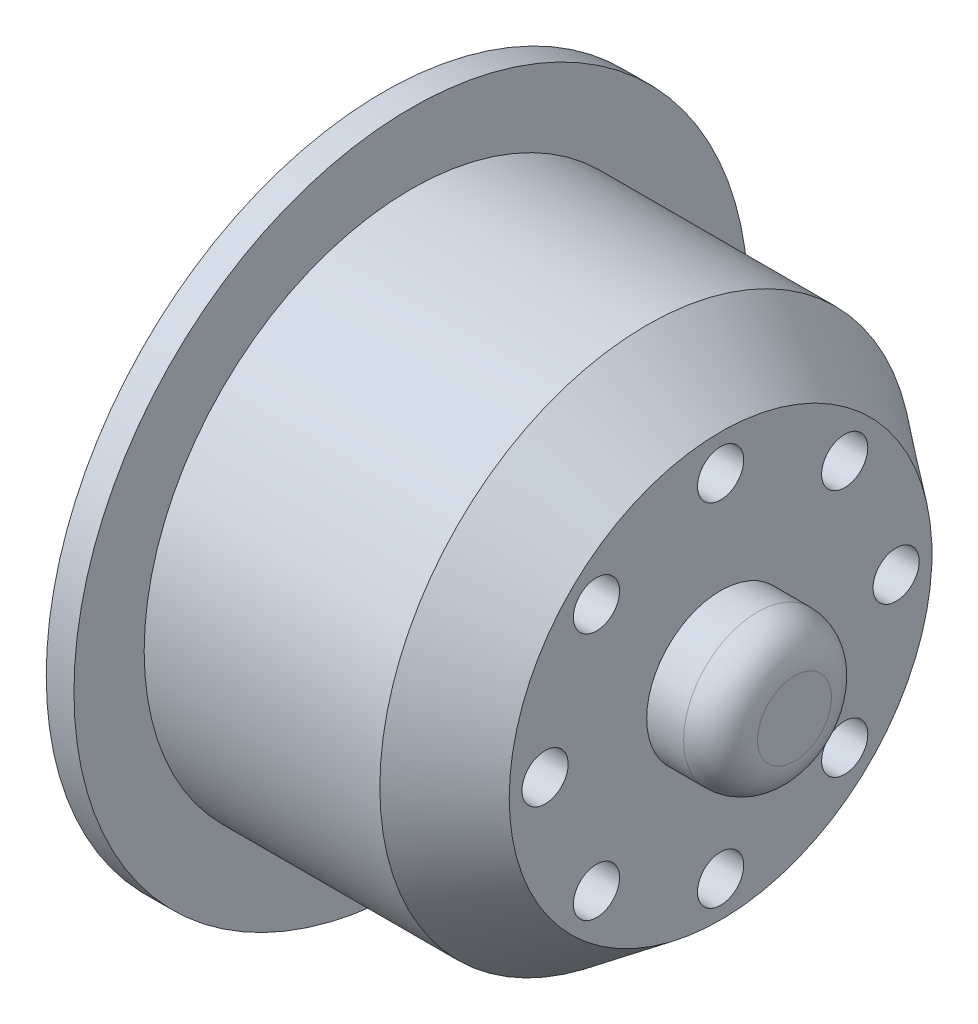
ISO-10303-21;
HEADER;
FILE_DESCRIPTION(('STEP AP214'),'2;1');
FILE_NAME('part.step','',(''),(''),'','','');
FILE_SCHEMA(('AUTOMOTIVE_DESIGN { 1 0 10303 214 1 1 1 1 }'));
ENDSEC;
DATA;
#1=APPLICATION_CONTEXT('core data for automotive mechanical design processes');
#2=APPLICATION_PROTOCOL_DEFINITION('international standard','automotive_design',2000,#1);
#3=PRODUCT_CONTEXT('',#1,'mechanical');
#4=PRODUCT('Part','Part','',(#3));
#5=PRODUCT_RELATED_PRODUCT_CATEGORY('part','',(#4));
#6=PRODUCT_DEFINITION_FORMATION('','',#4);
#7=PRODUCT_DEFINITION_CONTEXT('part definition',#1,'design');
#8=PRODUCT_DEFINITION('design','',#6,#7);
#9=PRODUCT_DEFINITION_SHAPE('','',#8);
#10=(LENGTH_UNIT() NAMED_UNIT(*) SI_UNIT(.MILLI.,.METRE.));
#11=(NAMED_UNIT(*) PLANE_ANGLE_UNIT() SI_UNIT($,.RADIAN.));
#12=(NAMED_UNIT(*) SI_UNIT($,.STERADIAN.) SOLID_ANGLE_UNIT());
#13=UNCERTAINTY_MEASURE_WITH_UNIT(LENGTH_MEASURE(1.E-05),#10,'distance_accuracy_value','');
#14=(GEOMETRIC_REPRESENTATION_CONTEXT(3) GLOBAL_UNCERTAINTY_ASSIGNED_CONTEXT((#13)) GLOBAL_UNIT_ASSIGNED_CONTEXT((#10,
#11,#12)) REPRESENTATION_CONTEXT('',''));
#15=CARTESIAN_POINT('',(0.,0.,0.));
#16=DIRECTION('',(0.,0.,1.));
#17=DIRECTION('',(1.,0.,0.));
#18=AXIS2_PLACEMENT_3D('',#15,#16,#17);
#19=CARTESIAN_POINT('',(-7.6304347826087,6.71751442127166,6.71751442127198));
#20=DIRECTION('',(1.,0.,0.));
#21=DIRECTION('',(0.,0.,-1.));
#22=AXIS2_PLACEMENT_3D('',#19,#20,#21);
#23=CYLINDRICAL_SURFACE('',#22,1.25);
#24=CARTESIAN_POINT('',(10.6195652173913,6.71751442127166,6.71751442127198));
#25=DIRECTION('',(1.,0.,0.));
#26=DIRECTION('',(0.,0.,-1.));
#27=AXIS2_PLACEMENT_3D('',#24,#25,#26);
#28=CIRCLE('',#27,1.25);
#29=CARTESIAN_POINT('',(10.6195652173913,6.71751442127166,5.46751442127198));
#30=VERTEX_POINT('',#29);
#31=EDGE_CURVE('E89',#30,#30,#28,.T.);
#32=ORIENTED_EDGE('',*,*,#31,.T.);
#33=EDGE_LOOP('',(#32));
#34=FACE_BOUND('',#33,.T.);
#35=CARTESIAN_POINT('',(5.61956521739131,6.71751442127166,6.71751442127198));
#36=DIRECTION('',(-1.,0.,0.));
#37=DIRECTION('',(0.,0.,1.));
#38=AXIS2_PLACEMENT_3D('',#35,#36,#37);
#39=CIRCLE('',#38,1.25);
#40=CARTESIAN_POINT('',(5.61956521739131,6.71751442127166,7.96751442127198));
#41=VERTEX_POINT('',#40);
#42=EDGE_CURVE('E43',#41,#41,#39,.F.);
#43=ORIENTED_EDGE('',*,*,#42,.F.);
#44=EDGE_LOOP('',(#43));
#45=FACE_BOUND('',#44,.T.);
#46=ADVANCED_FACE('F39',(#34,#45),#23,.F.);
#47=CARTESIAN_POINT('',(-7.6304347826087,-7.66926912071228E-13,9.49999999999923));
#48=DIRECTION('',(1.,0.,0.));
#49=DIRECTION('',(0.,0.,-1.));
#50=AXIS2_PLACEMENT_3D('',#47,#48,#49);
#51=CYLINDRICAL_SURFACE('',#50,1.25);
#52=CARTESIAN_POINT('',(10.6195652173913,-7.66926912071228E-13,9.49999999999923));
#53=DIRECTION('',(1.,0.,0.));
#54=DIRECTION('',(0.,0.,-1.));
#55=AXIS2_PLACEMENT_3D('',#52,#53,#54);
#56=CIRCLE('',#55,1.25);
#57=CARTESIAN_POINT('',(10.6195652173913,-7.66926912071228E-13,8.24999999999924));
#58=VERTEX_POINT('',#57);
#59=EDGE_CURVE('E94',#58,#58,#56,.T.);
#60=ORIENTED_EDGE('',*,*,#59,.T.);
#61=EDGE_LOOP('',(#60));
#62=FACE_BOUND('',#61,.T.);
#63=CARTESIAN_POINT('',(5.61956521739131,-7.66926912071228E-13,9.49999999999923));
#64=DIRECTION('',(-1.,0.,0.));
#65=DIRECTION('',(0.,0.,1.));
#66=AXIS2_PLACEMENT_3D('',#63,#64,#65);
#67=CIRCLE('',#66,1.25);
#68=CARTESIAN_POINT('',(5.61956521739131,-7.66926912071228E-13,10.7499999999992));
#69=VERTEX_POINT('',#68);
#70=EDGE_CURVE('E82',#69,#69,#67,.F.);
#71=ORIENTED_EDGE('',*,*,#70,.F.);
#72=EDGE_LOOP('',(#71));
#73=FACE_BOUND('',#72,.T.);
#74=ADVANCED_FACE('F166',(#62,#73),#51,.F.);
#75=CARTESIAN_POINT('',(-7.6304347826087,-6.71751442127274,6.7175144212709));
#76=DIRECTION('',(1.,0.,0.));
#77=DIRECTION('',(0.,0.,-1.));
#78=AXIS2_PLACEMENT_3D('',#75,#76,#77);
#79=CYLINDRICAL_SURFACE('',#78,1.25);
#80=CARTESIAN_POINT('',(10.6195652173913,-6.71751442127274,6.7175144212709));
#81=DIRECTION('',(1.,0.,0.));
#82=DIRECTION('',(0.,0.,-1.));
#83=AXIS2_PLACEMENT_3D('',#80,#81,#82);
#84=CIRCLE('',#83,1.25);
#85=CARTESIAN_POINT('',(10.6195652173913,-6.71751442127274,5.4675144212709));
#86=VERTEX_POINT('',#85);
#87=EDGE_CURVE('E100',#86,#86,#84,.T.);
#88=ORIENTED_EDGE('',*,*,#87,.T.);
#89=EDGE_LOOP('',(#88));
#90=FACE_BOUND('',#89,.T.);
#91=CARTESIAN_POINT('',(5.61956521739131,-6.71751442127274,6.7175144212709));
#92=DIRECTION('',(-1.,0.,0.));
#93=DIRECTION('',(0.,0.,1.));
#94=AXIS2_PLACEMENT_3D('',#91,#92,#93);
#95=CIRCLE('',#94,1.25);
#96=CARTESIAN_POINT('',(5.61956521739131,-6.71751442127274,7.9675144212709));
#97=VERTEX_POINT('',#96);
#98=EDGE_CURVE('E79',#97,#97,#95,.F.);
#99=ORIENTED_EDGE('',*,*,#98,.F.);
#100=EDGE_LOOP('',(#99));
#101=FACE_BOUND('',#100,.T.);
#102=ADVANCED_FACE('F171',(#90,#101),#79,.F.);
#103=CARTESIAN_POINT('',(-7.6304347826087,-9.5,-1.53152699522408E-12));
#104=DIRECTION('',(1.,0.,0.));
#105=DIRECTION('',(0.,0.,-1.));
#106=AXIS2_PLACEMENT_3D('',#103,#104,#105);
#107=CYLINDRICAL_SURFACE('',#106,1.25);
#108=CARTESIAN_POINT('',(10.6195652173913,-9.5,-1.53152699522408E-12));
#109=DIRECTION('',(1.,0.,0.));
#110=DIRECTION('',(0.,0.,-1.));
#111=AXIS2_PLACEMENT_3D('',#108,#109,#110);
#112=CIRCLE('',#111,1.25);
#113=CARTESIAN_POINT('',(10.6195652173913,-9.5,-1.25000000000153));
#114=VERTEX_POINT('',#113);
#115=EDGE_CURVE('E359',#114,#114,#112,.T.);
#116=ORIENTED_EDGE('',*,*,#115,.T.);
#117=EDGE_LOOP('',(#116));
#118=FACE_BOUND('',#117,.T.);
#119=CARTESIAN_POINT('',(5.61956521739131,-9.5,-1.53152699522408E-12));
#120=DIRECTION('',(-1.,0.,0.));
#121=DIRECTION('',(0.,0.,1.));
#122=AXIS2_PLACEMENT_3D('',#119,#120,#121);
#123=CIRCLE('',#122,1.25);
#124=CARTESIAN_POINT('',(5.61956521739131,-9.5,1.24999999999847));
#125=VERTEX_POINT('',#124);
#126=EDGE_CURVE('E75',#125,#125,#123,.F.);
#127=ORIENTED_EDGE('',*,*,#126,.F.);
#128=EDGE_LOOP('',(#127));
#129=FACE_BOUND('',#128,.T.);
#130=ADVANCED_FACE('F178',(#118,#129),#107,.F.);
#131=CARTESIAN_POINT('',(-7.6304347826087,-6.71751442127166,-6.71751442127351));
#132=DIRECTION('',(1.,0.,0.));
#133=DIRECTION('',(0.,0.,-1.));
#134=AXIS2_PLACEMENT_3D('',#131,#132,#133);
#135=CYLINDRICAL_SURFACE('',#134,1.25);
#136=CARTESIAN_POINT('',(10.6195652173913,-6.71751442127166,-6.71751442127351));
#137=DIRECTION('',(1.,0.,0.));
#138=DIRECTION('',(0.,0.,-1.));
#139=AXIS2_PLACEMENT_3D('',#136,#137,#138);
#140=CIRCLE('',#139,1.25);
#141=CARTESIAN_POINT('',(10.6195652173913,-6.71751442127166,-7.96751442127351));
#142=VERTEX_POINT('',#141);
#143=EDGE_CURVE('E355',#142,#142,#140,.T.);
#144=ORIENTED_EDGE('',*,*,#143,.T.);
#145=EDGE_LOOP('',(#144));
#146=FACE_BOUND('',#145,.T.);
#147=CARTESIAN_POINT('',(5.61956521739131,-6.71751442127166,-6.71751442127351));
#148=DIRECTION('',(-1.,0.,0.));
#149=DIRECTION('',(0.,0.,1.));
#150=AXIS2_PLACEMENT_3D('',#147,#148,#149);
#151=CIRCLE('',#150,1.25);
#152=CARTESIAN_POINT('',(5.61956521739131,-6.71751442127166,-5.46751442127351));
#153=VERTEX_POINT('',#152);
#154=EDGE_CURVE('E71',#153,#153,#151,.F.);
#155=ORIENTED_EDGE('',*,*,#154,.F.);
#156=EDGE_LOOP('',(#155));
#157=FACE_BOUND('',#156,.T.);
#158=ADVANCED_FACE('F182',(#146,#157),#135,.F.);
#159=CARTESIAN_POINT('',(-7.6304347826087,7.65763497612038E-13,-9.50000000000077));
#160=DIRECTION('',(1.,0.,0.));
#161=DIRECTION('',(0.,0.,-1.));
#162=AXIS2_PLACEMENT_3D('',#159,#160,#161);
#163=CYLINDRICAL_SURFACE('',#162,1.25);
#164=CARTESIAN_POINT('',(10.6195652173913,7.65763497612038E-13,-9.50000000000077));
#165=DIRECTION('',(1.,0.,0.));
#166=DIRECTION('',(0.,0.,-1.));
#167=AXIS2_PLACEMENT_3D('',#164,#165,#166);
#168=CIRCLE('',#167,1.25);
#169=CARTESIAN_POINT('',(10.6195652173913,7.65763497612038E-13,-10.7500000000008));
#170=VERTEX_POINT('',#169);
#171=EDGE_CURVE('E351',#170,#170,#168,.T.);
#172=ORIENTED_EDGE('',*,*,#171,.T.);
#173=EDGE_LOOP('',(#172));
#174=FACE_BOUND('',#173,.T.);
#175=CARTESIAN_POINT('',(5.61956521739131,7.65763497612038E-13,-9.50000000000077));
#176=DIRECTION('',(-1.,0.,0.));
#177=DIRECTION('',(0.,0.,1.));
#178=AXIS2_PLACEMENT_3D('',#175,#176,#177);
#179=CIRCLE('',#178,1.25);
#180=CARTESIAN_POINT('',(5.61956521739131,7.65763497612038E-13,-8.25000000000077));
#181=VERTEX_POINT('',#180);
#182=EDGE_CURVE('E67',#181,#181,#179,.F.);
#183=ORIENTED_EDGE('',*,*,#182,.F.);
#184=EDGE_LOOP('',(#183));
#185=FACE_BOUND('',#184,.T.);
#186=ADVANCED_FACE('F186',(#174,#185),#163,.F.);
#187=CARTESIAN_POINT('',(-7.6304347826087,6.71751442127274,-6.71751442127242));
#188=DIRECTION('',(1.,0.,0.));
#189=DIRECTION('',(0.,0.,-1.));
#190=AXIS2_PLACEMENT_3D('',#187,#188,#189);
#191=CYLINDRICAL_SURFACE('',#190,1.25);
#192=CARTESIAN_POINT('',(10.6195652173913,6.71751442127274,-6.71751442127242));
#193=DIRECTION('',(1.,0.,0.));
#194=DIRECTION('',(0.,0.,-1.));
#195=AXIS2_PLACEMENT_3D('',#192,#193,#194);
#196=CIRCLE('',#195,1.25);
#197=CARTESIAN_POINT('',(10.6195652173913,6.71751442127274,-7.96751442127243));
#198=VERTEX_POINT('',#197);
#199=EDGE_CURVE('E347',#198,#198,#196,.T.);
#200=ORIENTED_EDGE('',*,*,#199,.T.);
#201=EDGE_LOOP('',(#200));
#202=FACE_BOUND('',#201,.T.);
#203=CARTESIAN_POINT('',(5.61956521739131,6.71751442127274,-6.71751442127242));
#204=DIRECTION('',(-1.,0.,0.));
#205=DIRECTION('',(0.,0.,1.));
#206=AXIS2_PLACEMENT_3D('',#203,#204,#205);
#207=CIRCLE('',#206,1.25);
#208=CARTESIAN_POINT('',(5.61956521739131,6.71751442127274,-5.46751442127242));
#209=VERTEX_POINT('',#208);
#210=EDGE_CURVE('E62',#209,#209,#207,.F.);
#211=ORIENTED_EDGE('',*,*,#210,.F.);
#212=EDGE_LOOP('',(#211));
#213=FACE_BOUND('',#212,.T.);
#214=ADVANCED_FACE('F190',(#202,#213),#191,.F.);
#215=CARTESIAN_POINT('',(-7.6304347826087,9.5,0.));
#216=DIRECTION('',(1.,0.,0.));
#217=DIRECTION('',(0.,0.,-1.));
#218=AXIS2_PLACEMENT_3D('',#215,#216,#217);
#219=CYLINDRICAL_SURFACE('',#218,1.25);
#220=CARTESIAN_POINT('',(10.6195652173913,9.5,0.));
#221=DIRECTION('',(1.,0.,0.));
#222=DIRECTION('',(0.,0.,-1.));
#223=AXIS2_PLACEMENT_3D('',#220,#221,#222);
#224=CIRCLE('',#223,1.25);
#225=CARTESIAN_POINT('',(10.6195652173913,9.5,-1.25));
#226=VERTEX_POINT('',#225);
#227=EDGE_CURVE('E109',#226,#226,#224,.T.);
#228=ORIENTED_EDGE('',*,*,#227,.T.);
#229=EDGE_LOOP('',(#228));
#230=FACE_BOUND('',#229,.T.);
#231=CARTESIAN_POINT('',(5.61956521739131,9.5,0.));
#232=DIRECTION('',(-1.,0.,0.));
#233=DIRECTION('',(0.,0.,1.));
#234=AXIS2_PLACEMENT_3D('',#231,#232,#233);
#235=CIRCLE('',#234,1.25);
#236=CARTESIAN_POINT('',(5.61956521739131,9.5,1.25));
#237=VERTEX_POINT('',#236);
#238=EDGE_CURVE('E58',#237,#237,#235,.F.);
#239=ORIENTED_EDGE('',*,*,#238,.F.);
#240=EDGE_LOOP('',(#239));
#241=FACE_BOUND('',#240,.T.);
#242=ADVANCED_FACE('F133',(#230,#241),#219,.F.);
#243=CARTESIAN_POINT('',(-6.1304347826087,0.,-14.45));
#244=DIRECTION('',(-1.,0.,0.));
#245=DIRECTION('',(0.,0.,1.));
#246=AXIS2_PLACEMENT_3D('',#243,#244,#245);
#247=PLANE('',#246);
#248=CARTESIAN_POINT('',(-6.1304347826087,0.,0.));
#249=DIRECTION('',(-1.,0.,0.));
#250=DIRECTION('',(0.,0.,1.));
#251=AXIS2_PLACEMENT_3D('',#248,#249,#250);
#252=CIRCLE('',#251,18.25);
#253=CARTESIAN_POINT('',(-6.1304347826087,0.,18.25));
#254=VERTEX_POINT('',#253);
#255=EDGE_CURVE('E54',#254,#254,#252,.T.);
#256=ORIENTED_EDGE('',*,*,#255,.F.);
#257=EDGE_LOOP('',(#256));
#258=FACE_BOUND('',#257,.T.);
#259=CARTESIAN_POINT('',(-6.1304347826087,0.,0.));
#260=DIRECTION('',(-1.,0.,0.));
#261=DIRECTION('',(0.,0.,1.));
#262=AXIS2_PLACEMENT_3D('',#259,#260,#261);
#263=CIRCLE('',#262,14.45);
#264=CARTESIAN_POINT('',(-6.1304347826087,0.,14.45));
#265=VERTEX_POINT('',#264);
#266=EDGE_CURVE('E104',#265,#265,#263,.T.);
#267=ORIENTED_EDGE('',*,*,#266,.T.);
#268=EDGE_LOOP('',(#267));
#269=FACE_BOUND('',#268,.T.);
#270=ADVANCED_FACE('F130',(#258,#269),#247,.F.);
#271=CARTESIAN_POINT('',(-12.3913043478261,0.,0.));
#272=DIRECTION('',(-1.,0.,0.));
#273=DIRECTION('',(0.,0.,1.));
#274=AXIS2_PLACEMENT_3D('',#271,#272,#273);
#275=CYLINDRICAL_SURFACE('',#274,18.25);
#276=CARTESIAN_POINT('',(-7.6304347826087,0.,0.));
#277=DIRECTION('',(-1.,0.,0.));
#278=DIRECTION('',(0.,0.,1.));
#279=AXIS2_PLACEMENT_3D('',#276,#277,#278);
#280=CIRCLE('',#279,18.25);
#281=CARTESIAN_POINT('',(-7.6304347826087,0.,18.25));
#282=VERTEX_POINT('',#281);
#283=EDGE_CURVE('E121',#282,#282,#280,.T.);
#284=ORIENTED_EDGE('',*,*,#283,.F.);
#285=EDGE_LOOP('',(#284));
#286=FACE_BOUND('',#285,.T.);
#287=ORIENTED_EDGE('',*,*,#255,.T.);
#288=EDGE_LOOP('',(#287));
#289=FACE_BOUND('',#288,.T.);
#290=ADVANCED_FACE('F128',(#286,#289),#275,.T.);
#291=CARTESIAN_POINT('',(-7.6304347826087,0.,-18.25));
#292=DIRECTION('',(1.,0.,0.));
#293=DIRECTION('',(0.,0.,-1.));
#294=AXIS2_PLACEMENT_3D('',#291,#292,#293);
#295=PLANE('',#294);
#296=CARTESIAN_POINT('',(-7.6304347826087,0.,0.));
#297=DIRECTION('',(-1.,0.,0.));
#298=DIRECTION('',(0.,0.,1.));
#299=AXIS2_PLACEMENT_3D('',#296,#297,#298);
#300=CIRCLE('',#299,5.1);
#301=CARTESIAN_POINT('',(-7.6304347826087,0.,5.1));
#302=VERTEX_POINT('',#301);
#303=EDGE_CURVE('E276',#302,#302,#300,.T.);
#304=ORIENTED_EDGE('',*,*,#303,.F.);
#305=EDGE_LOOP('',(#304));
#306=FACE_BOUND('',#305,.T.);
#307=CARTESIAN_POINT('',(-7.6304347826087,6.71751442127125,-6.71751442127159));
#308=DIRECTION('',(-1.,0.,0.));
#309=DIRECTION('',(0.,0.,1.));
#310=AXIS2_PLACEMENT_3D('',#307,#308,#309);
#311=CIRCLE('',#310,2.50000000000051);
#312=CARTESIAN_POINT('',(-7.6304347826087,6.71751442127125,-4.21751442127108));
#313=VERTEX_POINT('',#312);
#314=EDGE_CURVE('E275',#313,#313,#311,.T.);
#315=ORIENTED_EDGE('',*,*,#314,.F.);
#316=EDGE_LOOP('',(#315));
#317=FACE_BOUND('',#316,.T.);
#318=CARTESIAN_POINT('',(-7.6304347826087,-8.09437011536873E-13,-9.49999999999865));
#319=DIRECTION('',(-1.,0.,0.));
#320=DIRECTION('',(0.,0.,1.));
#321=AXIS2_PLACEMENT_3D('',#318,#319,#320);
#322=CIRCLE('',#321,2.5000000000011);
#323=CARTESIAN_POINT('',(-7.6304347826087,-8.09437011536873E-13,-6.99999999999755));
#324=VERTEX_POINT('',#323);
#325=EDGE_CURVE('E328',#324,#324,#322,.T.);
#326=ORIENTED_EDGE('',*,*,#325,.F.);
#327=EDGE_LOOP('',(#326));
#328=FACE_BOUND('',#327,.T.);
#329=CARTESIAN_POINT('',(-7.6304347826087,-6.71751442127239,-6.71751442127044));
#330=DIRECTION('',(-1.,0.,0.));
#331=DIRECTION('',(0.,0.,1.));
#332=AXIS2_PLACEMENT_3D('',#329,#330,#331);
#333=CIRCLE('',#332,2.50000000000157);
#334=CARTESIAN_POINT('',(-7.6304347826087,-6.71751442127239,-4.21751442126887));
#335=VERTEX_POINT('',#334);
#336=EDGE_CURVE('E320',#335,#335,#333,.T.);
#337=ORIENTED_EDGE('',*,*,#336,.F.);
#338=EDGE_LOOP('',(#337));
#339=FACE_BOUND('',#338,.T.);
#340=CARTESIAN_POINT('',(-7.6304347826087,-9.49999999999946,1.61654719415537E-12));
#341=DIRECTION('',(-1.,0.,0.));
#342=DIRECTION('',(0.,0.,1.));
#343=AXIS2_PLACEMENT_3D('',#340,#341,#342);
#344=CIRCLE('',#343,2.50000000000161);
#345=CARTESIAN_POINT('',(-7.6304347826087,-9.49999999999946,2.50000000000323));
#346=VERTEX_POINT('',#345);
#347=EDGE_CURVE('E312',#346,#346,#344,.T.);
#348=ORIENTED_EDGE('',*,*,#347,.F.);
#349=EDGE_LOOP('',(#348));
#350=FACE_BOUND('',#349,.T.);
#351=CARTESIAN_POINT('',(-7.6304347826087,-6.71751442127125,6.7175144212732));
#352=DIRECTION('',(-1.,0.,0.));
#353=DIRECTION('',(0.,0.,1.));
#354=AXIS2_PLACEMENT_3D('',#351,#352,#353);
#355=CIRCLE('',#354,2.5000000000012);
#356=CARTESIAN_POINT('',(-7.6304347826087,-6.71751442127125,9.2175144212744));
#357=VERTEX_POINT('',#356);
#358=EDGE_CURVE('E304',#357,#357,#355,.T.);
#359=ORIENTED_EDGE('',*,*,#358,.F.);
#360=EDGE_LOOP('',(#359));
#361=FACE_BOUND('',#360,.T.);
#362=CARTESIAN_POINT('',(-7.6304347826087,8.08273597077683E-13,9.50000000000027));
#363=DIRECTION('',(-1.,0.,0.));
#364=DIRECTION('',(0.,0.,1.));
#365=AXIS2_PLACEMENT_3D('',#362,#363,#364);
#366=CIRCLE('',#365,2.50000000000057);
#367=CARTESIAN_POINT('',(-7.6304347826087,8.08273597077683E-13,12.0000000000008));
#368=VERTEX_POINT('',#367);
#369=EDGE_CURVE('E296',#368,#368,#366,.T.);
#370=ORIENTED_EDGE('',*,*,#369,.F.);
#371=EDGE_LOOP('',(#370));
#372=FACE_BOUND('',#371,.T.);
#373=CARTESIAN_POINT('',(-7.6304347826087,6.71751442127239,6.71751442127206));
#374=DIRECTION('',(-1.,0.,0.));
#375=DIRECTION('',(0.,0.,1.));
#376=AXIS2_PLACEMENT_3D('',#373,#374,#375);
#377=CIRCLE('',#376,2.50000000000008);
#378=CARTESIAN_POINT('',(-7.6304347826087,6.71751442127239,9.21751442127213));
#379=VERTEX_POINT('',#378);
#380=EDGE_CURVE('E286',#379,#379,#377,.T.);
#381=ORIENTED_EDGE('',*,*,#380,.F.);
#382=EDGE_LOOP('',(#381));
#383=FACE_BOUND('',#382,.T.);
#384=CARTESIAN_POINT('',(-7.6304347826087,9.49999999999946,0.));
#385=DIRECTION('',(-1.,0.,0.));
#386=DIRECTION('',(0.,0.,1.));
#387=AXIS2_PLACEMENT_3D('',#384,#385,#386);
#388=CIRCLE('',#387,2.5);
#389=CARTESIAN_POINT('',(-7.6304347826087,9.49999999999946,2.5));
#390=VERTEX_POINT('',#389);
#391=EDGE_CURVE('E295',#390,#390,#388,.T.);
#392=ORIENTED_EDGE('',*,*,#391,.F.);
#393=EDGE_LOOP('',(#392));
#394=FACE_BOUND('',#393,.T.);
#395=ORIENTED_EDGE('',*,*,#283,.T.);
#396=EDGE_LOOP('',(#395));
#397=FACE_BOUND('',#396,.T.);
#398=ADVANCED_FACE('F163',(#306,#317,#328,#339,#350,#361,#372,#383,#394,#397),#295,.F.);
#399=CARTESIAN_POINT('',(14.6195652173913,0.,-4.));
#400=DIRECTION('',(-1.,0.,0.));
#401=DIRECTION('',(0.,0.,1.));
#402=AXIS2_PLACEMENT_3D('',#399,#400,#401);
#403=PLANE('',#402);
#404=CARTESIAN_POINT('',(14.6195652173913,0.,0.));
#405=DIRECTION('',(-1.,0.,0.));
#406=DIRECTION('',(0.,0.,1.));
#407=AXIS2_PLACEMENT_3D('',#404,#405,#406);
#408=CIRCLE('',#407,2.);
#409=CARTESIAN_POINT('',(14.6195652173913,0.,2.));
#410=VERTEX_POINT('',#409);
#411=EDGE_CURVE('E11',#410,#410,#408,.F.);
#412=ORIENTED_EDGE('',*,*,#411,.T.);
#413=EDGE_LOOP('',(#412));
#414=FACE_BOUND('',#413,.T.);
#415=ADVANCED_FACE('F157',(#414),#403,.F.);
#416=CARTESIAN_POINT('',(-12.3913043478261,0.,0.));
#417=DIRECTION('',(-1.,0.,0.));
#418=DIRECTION('',(0.,0.,1.));
#419=AXIS2_PLACEMENT_3D('',#416,#417,#418);
#420=CYLINDRICAL_SURFACE('',#419,4.);
#421=CARTESIAN_POINT('',(12.6195652173913,0.,0.));
#422=DIRECTION('',(-1.,0.,0.));
#423=DIRECTION('',(0.,0.,1.));
#424=AXIS2_PLACEMENT_3D('',#421,#422,#423);
#425=CIRCLE('',#424,4.);
#426=CARTESIAN_POINT('',(12.6195652173913,0.,4.));
#427=VERTEX_POINT('',#426);
#428=EDGE_CURVE('E48',#427,#427,#425,.T.);
#429=ORIENTED_EDGE('',*,*,#428,.T.);
#430=EDGE_LOOP('',(#429));
#431=FACE_BOUND('',#430,.T.);
#432=CARTESIAN_POINT('',(10.6195652173913,0.,0.));
#433=DIRECTION('',(-1.,0.,0.));
#434=DIRECTION('',(0.,0.,1.));
#435=AXIS2_PLACEMENT_3D('',#432,#433,#434);
#436=CIRCLE('',#435,4.);
#437=CARTESIAN_POINT('',(10.6195652173913,0.,4.));
#438=VERTEX_POINT('',#437);
#439=EDGE_CURVE('E117',#438,#438,#436,.T.);
#440=ORIENTED_EDGE('',*,*,#439,.F.);
#441=EDGE_LOOP('',(#440));
#442=FACE_BOUND('',#441,.T.);
#443=ADVANCED_FACE('F151',(#431,#442),#420,.T.);
#444=CARTESIAN_POINT('',(10.6195652173913,0.,-11.4409248842397));
#445=DIRECTION('',(-1.,0.,0.));
#446=DIRECTION('',(0.,0.,1.));
#447=AXIS2_PLACEMENT_3D('',#444,#445,#446);
#448=PLANE('',#447);
#449=ORIENTED_EDGE('',*,*,#227,.F.);
#450=EDGE_LOOP('',(#449));
#451=FACE_BOUND('',#450,.T.);
#452=ORIENTED_EDGE('',*,*,#199,.F.);
#453=EDGE_LOOP('',(#452));
#454=FACE_BOUND('',#453,.T.);
#455=ORIENTED_EDGE('',*,*,#171,.F.);
#456=EDGE_LOOP('',(#455));
#457=FACE_BOUND('',#456,.T.);
#458=ORIENTED_EDGE('',*,*,#143,.F.);
#459=EDGE_LOOP('',(#458));
#460=FACE_BOUND('',#459,.T.);
#461=ORIENTED_EDGE('',*,*,#115,.F.);
#462=EDGE_LOOP('',(#461));
#463=FACE_BOUND('',#462,.T.);
#464=ORIENTED_EDGE('',*,*,#87,.F.);
#465=EDGE_LOOP('',(#464));
#466=FACE_BOUND('',#465,.T.);
#467=ORIENTED_EDGE('',*,*,#59,.F.);
#468=EDGE_LOOP('',(#467));
#469=FACE_BOUND('',#468,.T.);
#470=ORIENTED_EDGE('',*,*,#31,.F.);
#471=EDGE_LOOP('',(#470));
#472=FACE_BOUND('',#471,.T.);
#473=CARTESIAN_POINT('',(10.6195652173913,0.,0.));
#474=DIRECTION('',(-1.,0.,0.));
#475=DIRECTION('',(0.,0.,1.));
#476=AXIS2_PLACEMENT_3D('',#473,#474,#475);
#477=CIRCLE('',#476,11.4409248842397);
#478=CARTESIAN_POINT('',(10.6195652173913,0.,11.4409248842397));
#479=VERTEX_POINT('',#478);
#480=EDGE_CURVE('E113',#479,#479,#477,.T.);
#481=ORIENTED_EDGE('',*,*,#480,.F.);
#482=EDGE_LOOP('',(#481));
#483=FACE_BOUND('',#482,.T.);
#484=ORIENTED_EDGE('',*,*,#439,.T.);
#485=EDGE_LOOP('',(#484));
#486=FACE_BOUND('',#485,.T.);
#487=ADVANCED_FACE('F145',(#451,#454,#457,#460,#463,#466,#469,#472,#483,#486),#448,.F.);
#488=CARTESIAN_POINT('',(10.6195652173913,0.,0.));
#489=DIRECTION('',(-1.,0.,0.));
#490=DIRECTION('',(0.,0.,1.));
#491=AXIS2_PLACEMENT_3D('',#488,#489,#490);
#492=CONICAL_SURFACE('',#491,11.4409248842397,0.645771823237905);
#493=CARTESIAN_POINT('',(6.62638766715485,0.,0.));
#494=DIRECTION('',(-1.,0.,0.));
#495=DIRECTION('',(0.,0.,1.));
#496=AXIS2_PLACEMENT_3D('',#493,#494,#495);
#497=CIRCLE('',#496,14.45);
#498=CARTESIAN_POINT('',(6.62638766715485,0.,14.45));
#499=VERTEX_POINT('',#498);
#500=EDGE_CURVE('E108',#499,#499,#497,.T.);
#501=ORIENTED_EDGE('',*,*,#500,.F.);
#502=EDGE_LOOP('',(#501));
#503=FACE_BOUND('',#502,.T.);
#504=ORIENTED_EDGE('',*,*,#480,.T.);
#505=EDGE_LOOP('',(#504));
#506=FACE_BOUND('',#505,.T.);
#507=ADVANCED_FACE('F139',(#503,#506),#492,.T.);
#508=CARTESIAN_POINT('',(-12.3913043478261,0.,0.));
#509=DIRECTION('',(-1.,0.,0.));
#510=DIRECTION('',(0.,0.,1.));
#511=AXIS2_PLACEMENT_3D('',#508,#509,#510);
#512=CYLINDRICAL_SURFACE('',#511,14.45);
#513=ORIENTED_EDGE('',*,*,#266,.F.);
#514=EDGE_LOOP('',(#513));
#515=FACE_BOUND('',#514,.T.);
#516=ORIENTED_EDGE('',*,*,#500,.T.);
#517=EDGE_LOOP('',(#516));
#518=FACE_BOUND('',#517,.T.);
#519=ADVANCED_FACE('F136',(#515,#518),#512,.T.);
#520=CARTESIAN_POINT('',(12.6195652173913,0.,0.));
#521=DIRECTION('',(-1.,0.,0.));
#522=DIRECTION('',(0.,0.,1.));
#523=AXIS2_PLACEMENT_3D('',#520,#521,#522);
#524=DEGENERATE_TOROIDAL_SURFACE('',#523,2.,2.,.T.);
#525=ORIENTED_EDGE('',*,*,#411,.F.);
#526=EDGE_LOOP('',(#525));
#527=FACE_BOUND('',#526,.T.);
#528=ORIENTED_EDGE('',*,*,#428,.F.);
#529=EDGE_LOOP('',(#528));
#530=FACE_BOUND('',#529,.T.);
#531=ADVANCED_FACE('F41',(#527,#530),#524,.T.);
#532=CARTESIAN_POINT('',(5.61956521739131,0.,-11.4409248842397));
#533=DIRECTION('',(-1.,0.,0.));
#534=DIRECTION('',(0.,0.,1.));
#535=AXIS2_PLACEMENT_3D('',#532,#533,#534);
#536=PLANE('',#535);
#537=CARTESIAN_POINT('',(5.61956521739131,9.49999999999946,0.));
#538=DIRECTION('',(-1.,0.,0.));
#539=DIRECTION('',(0.,0.,1.));
#540=AXIS2_PLACEMENT_3D('',#537,#538,#539);
#541=CIRCLE('',#540,2.5);
#542=CARTESIAN_POINT('',(5.61956521739131,9.49999999999946,2.5));
#543=VERTEX_POINT('',#542);
#544=EDGE_CURVE('E63',#543,#543,#541,.F.);
#545=ORIENTED_EDGE('',*,*,#544,.F.);
#546=EDGE_LOOP('',(#545));
#547=FACE_BOUND('',#546,.T.);
#548=ORIENTED_EDGE('',*,*,#238,.T.);
#549=EDGE_LOOP('',(#548));
#550=FACE_BOUND('',#549,.T.);
#551=ADVANCED_FACE('F202',(#547,#550),#536,.T.);
#552=CARTESIAN_POINT('',(17.6906330292613,9.49999999999946,0.));
#553=DIRECTION('',(-1.,0.,0.));
#554=DIRECTION('',(0.,0.,1.));
#555=AXIS2_PLACEMENT_3D('',#552,#553,#554);
#556=CYLINDRICAL_SURFACE('',#555,2.5);
#557=ORIENTED_EDGE('',*,*,#544,.T.);
#558=EDGE_LOOP('',(#557));
#559=FACE_BOUND('',#558,.T.);
#560=ORIENTED_EDGE('',*,*,#391,.T.);
#561=EDGE_LOOP('',(#560));
#562=FACE_BOUND('',#561,.T.);
#563=ADVANCED_FACE('F198',(#559,#562),#556,.F.);
#564=CARTESIAN_POINT('',(5.61956521739131,0.,-11.4409248842397));
#565=DIRECTION('',(-1.,0.,0.));
#566=DIRECTION('',(0.,0.,1.));
#567=AXIS2_PLACEMENT_3D('',#564,#565,#566);
#568=PLANE('',#567);
#569=CARTESIAN_POINT('',(5.61956521739131,6.71751442127125,-6.71751442127159));
#570=DIRECTION('',(-1.,0.,0.));
#571=DIRECTION('',(0.,0.,1.));
#572=AXIS2_PLACEMENT_3D('',#569,#570,#571);
#573=CIRCLE('',#572,2.50000000000051);
#574=CARTESIAN_POINT('',(5.61956521739131,6.71751442127125,-4.21751442127108));
#575=VERTEX_POINT('',#574);
#576=EDGE_CURVE('E281',#575,#575,#573,.F.);
#577=ORIENTED_EDGE('',*,*,#576,.F.);
#578=EDGE_LOOP('',(#577));
#579=FACE_BOUND('',#578,.T.);
#580=ORIENTED_EDGE('',*,*,#210,.T.);
#581=EDGE_LOOP('',(#580));
#582=FACE_BOUND('',#581,.T.);
#583=ADVANCED_FACE('F201',(#579,#582),#568,.T.);
#584=CARTESIAN_POINT('',(17.6906330292613,6.71751442127125,-6.71751442127159));
#585=DIRECTION('',(-1.,0.,0.));
#586=DIRECTION('',(0.,0.,1.));
#587=AXIS2_PLACEMENT_3D('',#584,#585,#586);
#588=CYLINDRICAL_SURFACE('',#587,2.50000000000051);
#589=ORIENTED_EDGE('',*,*,#576,.T.);
#590=EDGE_LOOP('',(#589));
#591=FACE_BOUND('',#590,.T.);
#592=ORIENTED_EDGE('',*,*,#314,.T.);
#593=EDGE_LOOP('',(#592));
#594=FACE_BOUND('',#593,.T.);
#595=ADVANCED_FACE('F207',(#591,#594),#588,.F.);
#596=CARTESIAN_POINT('',(5.61956521739131,0.,-11.4409248842397));
#597=DIRECTION('',(-1.,0.,0.));
#598=DIRECTION('',(0.,0.,1.));
#599=AXIS2_PLACEMENT_3D('',#596,#597,#598);
#600=PLANE('',#599);
#601=CARTESIAN_POINT('',(5.61956521739131,-8.09437011536873E-13,-9.49999999999865));
#602=DIRECTION('',(-1.,0.,0.));
#603=DIRECTION('',(0.,0.,1.));
#604=AXIS2_PLACEMENT_3D('',#601,#602,#603);
#605=CIRCLE('',#604,2.5000000000011);
#606=CARTESIAN_POINT('',(5.61956521739131,-8.09437011536873E-13,-6.99999999999755));
#607=VERTEX_POINT('',#606);
#608=EDGE_CURVE('E324',#607,#607,#605,.F.);
#609=ORIENTED_EDGE('',*,*,#608,.F.);
#610=EDGE_LOOP('',(#609));
#611=FACE_BOUND('',#610,.T.);
#612=ORIENTED_EDGE('',*,*,#182,.T.);
#613=EDGE_LOOP('',(#612));
#614=FACE_BOUND('',#613,.T.);
#615=ADVANCED_FACE('F210',(#611,#614),#600,.T.);
#616=CARTESIAN_POINT('',(17.6906330292613,-8.09437011536873E-13,-9.49999999999865));
#617=DIRECTION('',(-1.,0.,0.));
#618=DIRECTION('',(0.,0.,1.));
#619=AXIS2_PLACEMENT_3D('',#616,#617,#618);
#620=CYLINDRICAL_SURFACE('',#619,2.5000000000011);
#621=ORIENTED_EDGE('',*,*,#608,.T.);
#622=EDGE_LOOP('',(#621));
#623=FACE_BOUND('',#622,.T.);
#624=ORIENTED_EDGE('',*,*,#325,.T.);
#625=EDGE_LOOP('',(#624));
#626=FACE_BOUND('',#625,.T.);
#627=ADVANCED_FACE('F215',(#623,#626),#620,.F.);
#628=CARTESIAN_POINT('',(5.61956521739131,0.,-11.4409248842397));
#629=DIRECTION('',(-1.,0.,0.));
#630=DIRECTION('',(0.,0.,1.));
#631=AXIS2_PLACEMENT_3D('',#628,#629,#630);
#632=PLANE('',#631);
#633=CARTESIAN_POINT('',(5.61956521739131,-6.71751442127239,-6.71751442127044));
#634=DIRECTION('',(-1.,0.,0.));
#635=DIRECTION('',(0.,0.,1.));
#636=AXIS2_PLACEMENT_3D('',#633,#634,#635);
#637=CIRCLE('',#636,2.50000000000157);
#638=CARTESIAN_POINT('',(5.61956521739131,-6.71751442127239,-4.21751442126887));
#639=VERTEX_POINT('',#638);
#640=EDGE_CURVE('E316',#639,#639,#637,.F.);
#641=ORIENTED_EDGE('',*,*,#640,.F.);
#642=EDGE_LOOP('',(#641));
#643=FACE_BOUND('',#642,.T.);
#644=ORIENTED_EDGE('',*,*,#154,.T.);
#645=EDGE_LOOP('',(#644));
#646=FACE_BOUND('',#645,.T.);
#647=ADVANCED_FACE('F218',(#643,#646),#632,.T.);
#648=CARTESIAN_POINT('',(17.6906330292613,-6.71751442127239,-6.71751442127044));
#649=DIRECTION('',(-1.,0.,0.));
#650=DIRECTION('',(0.,0.,1.));
#651=AXIS2_PLACEMENT_3D('',#648,#649,#650);
#652=CYLINDRICAL_SURFACE('',#651,2.50000000000157);
#653=ORIENTED_EDGE('',*,*,#640,.T.);
#654=EDGE_LOOP('',(#653));
#655=FACE_BOUND('',#654,.T.);
#656=ORIENTED_EDGE('',*,*,#336,.T.);
#657=EDGE_LOOP('',(#656));
#658=FACE_BOUND('',#657,.T.);
#659=ADVANCED_FACE('F223',(#655,#658),#652,.F.);
#660=CARTESIAN_POINT('',(5.61956521739131,0.,-11.4409248842397));
#661=DIRECTION('',(-1.,0.,0.));
#662=DIRECTION('',(0.,0.,1.));
#663=AXIS2_PLACEMENT_3D('',#660,#661,#662);
#664=PLANE('',#663);
#665=CARTESIAN_POINT('',(5.61956521739131,-9.49999999999946,1.61654719415537E-12));
#666=DIRECTION('',(-1.,0.,0.));
#667=DIRECTION('',(0.,0.,1.));
#668=AXIS2_PLACEMENT_3D('',#665,#666,#667);
#669=CIRCLE('',#668,2.50000000000161);
#670=CARTESIAN_POINT('',(5.61956521739131,-9.49999999999946,2.50000000000323));
#671=VERTEX_POINT('',#670);
#672=EDGE_CURVE('E308',#671,#671,#669,.F.);
#673=ORIENTED_EDGE('',*,*,#672,.F.);
#674=EDGE_LOOP('',(#673));
#675=FACE_BOUND('',#674,.T.);
#676=ORIENTED_EDGE('',*,*,#126,.T.);
#677=EDGE_LOOP('',(#676));
#678=FACE_BOUND('',#677,.T.);
#679=ADVANCED_FACE('F226',(#675,#678),#664,.T.);
#680=CARTESIAN_POINT('',(17.6906330292613,-9.49999999999946,1.61654719415537E-12));
#681=DIRECTION('',(-1.,0.,0.));
#682=DIRECTION('',(0.,0.,1.));
#683=AXIS2_PLACEMENT_3D('',#680,#681,#682);
#684=CYLINDRICAL_SURFACE('',#683,2.50000000000161);
#685=ORIENTED_EDGE('',*,*,#672,.T.);
#686=EDGE_LOOP('',(#685));
#687=FACE_BOUND('',#686,.T.);
#688=ORIENTED_EDGE('',*,*,#347,.T.);
#689=EDGE_LOOP('',(#688));
#690=FACE_BOUND('',#689,.T.);
#691=ADVANCED_FACE('F231',(#687,#690),#684,.F.);
#692=CARTESIAN_POINT('',(5.61956521739131,0.,-11.4409248842397));
#693=DIRECTION('',(-1.,0.,0.));
#694=DIRECTION('',(0.,0.,1.));
#695=AXIS2_PLACEMENT_3D('',#692,#693,#694);
#696=PLANE('',#695);
#697=CARTESIAN_POINT('',(5.61956521739131,-6.71751442127125,6.7175144212732));
#698=DIRECTION('',(-1.,0.,0.));
#699=DIRECTION('',(0.,0.,1.));
#700=AXIS2_PLACEMENT_3D('',#697,#698,#699);
#701=CIRCLE('',#700,2.5000000000012);
#702=CARTESIAN_POINT('',(5.61956521739131,-6.71751442127125,9.2175144212744));
#703=VERTEX_POINT('',#702);
#704=EDGE_CURVE('E300',#703,#703,#701,.F.);
#705=ORIENTED_EDGE('',*,*,#704,.F.);
#706=EDGE_LOOP('',(#705));
#707=FACE_BOUND('',#706,.T.);
#708=ORIENTED_EDGE('',*,*,#98,.T.);
#709=EDGE_LOOP('',(#708));
#710=FACE_BOUND('',#709,.T.);
#711=ADVANCED_FACE('F234',(#707,#710),#696,.T.);
#712=CARTESIAN_POINT('',(17.6906330292613,-6.71751442127125,6.7175144212732));
#713=DIRECTION('',(-1.,0.,0.));
#714=DIRECTION('',(0.,0.,1.));
#715=AXIS2_PLACEMENT_3D('',#712,#713,#714);
#716=CYLINDRICAL_SURFACE('',#715,2.5000000000012);
#717=ORIENTED_EDGE('',*,*,#704,.T.);
#718=EDGE_LOOP('',(#717));
#719=FACE_BOUND('',#718,.T.);
#720=ORIENTED_EDGE('',*,*,#358,.T.);
#721=EDGE_LOOP('',(#720));
#722=FACE_BOUND('',#721,.T.);
#723=ADVANCED_FACE('F239',(#719,#722),#716,.F.);
#724=CARTESIAN_POINT('',(5.61956521739131,0.,-11.4409248842397));
#725=DIRECTION('',(-1.,0.,0.));
#726=DIRECTION('',(0.,0.,1.));
#727=AXIS2_PLACEMENT_3D('',#724,#725,#726);
#728=PLANE('',#727);
#729=CARTESIAN_POINT('',(5.61956521739131,8.08273597077683E-13,9.50000000000027));
#730=DIRECTION('',(-1.,0.,0.));
#731=DIRECTION('',(0.,0.,1.));
#732=AXIS2_PLACEMENT_3D('',#729,#730,#731);
#733=CIRCLE('',#732,2.50000000000057);
#734=CARTESIAN_POINT('',(5.61956521739131,8.08273597077683E-13,12.0000000000008));
#735=VERTEX_POINT('',#734);
#736=EDGE_CURVE('E291',#735,#735,#733,.F.);
#737=ORIENTED_EDGE('',*,*,#736,.F.);
#738=EDGE_LOOP('',(#737));
#739=FACE_BOUND('',#738,.T.);
#740=ORIENTED_EDGE('',*,*,#70,.T.);
#741=EDGE_LOOP('',(#740));
#742=FACE_BOUND('',#741,.T.);
#743=ADVANCED_FACE('F242',(#739,#742),#728,.T.);
#744=CARTESIAN_POINT('',(17.6906330292613,8.08273597077683E-13,9.50000000000027));
#745=DIRECTION('',(-1.,0.,0.));
#746=DIRECTION('',(0.,0.,1.));
#747=AXIS2_PLACEMENT_3D('',#744,#745,#746);
#748=CYLINDRICAL_SURFACE('',#747,2.50000000000057);
#749=ORIENTED_EDGE('',*,*,#736,.T.);
#750=EDGE_LOOP('',(#749));
#751=FACE_BOUND('',#750,.T.);
#752=ORIENTED_EDGE('',*,*,#369,.T.);
#753=EDGE_LOOP('',(#752));
#754=FACE_BOUND('',#753,.T.);
#755=ADVANCED_FACE('F247',(#751,#754),#748,.F.);
#756=CARTESIAN_POINT('',(5.61956521739131,0.,-11.4409248842397));
#757=DIRECTION('',(-1.,0.,0.));
#758=DIRECTION('',(0.,0.,1.));
#759=AXIS2_PLACEMENT_3D('',#756,#757,#758);
#760=PLANE('',#759);
#761=CARTESIAN_POINT('',(5.61956521739131,6.71751442127239,6.71751442127206));
#762=DIRECTION('',(-1.,0.,0.));
#763=DIRECTION('',(0.,0.,1.));
#764=AXIS2_PLACEMENT_3D('',#761,#762,#763);
#765=CIRCLE('',#764,2.50000000000008);
#766=CARTESIAN_POINT('',(5.61956521739131,6.71751442127239,9.21751442127213));
#767=VERTEX_POINT('',#766);
#768=EDGE_CURVE('E290',#767,#767,#765,.F.);
#769=ORIENTED_EDGE('',*,*,#768,.F.);
#770=EDGE_LOOP('',(#769));
#771=FACE_BOUND('',#770,.T.);
#772=ORIENTED_EDGE('',*,*,#42,.T.);
#773=EDGE_LOOP('',(#772));
#774=FACE_BOUND('',#773,.T.);
#775=ADVANCED_FACE('F250',(#771,#774),#760,.T.);
#776=CARTESIAN_POINT('',(17.6906330292613,6.71751442127239,6.71751442127206));
#777=DIRECTION('',(-1.,0.,0.));
#778=DIRECTION('',(0.,0.,1.));
#779=AXIS2_PLACEMENT_3D('',#776,#777,#778);
#780=CYLINDRICAL_SURFACE('',#779,2.50000000000008);
#781=ORIENTED_EDGE('',*,*,#768,.T.);
#782=EDGE_LOOP('',(#781));
#783=FACE_BOUND('',#782,.T.);
#784=ORIENTED_EDGE('',*,*,#380,.T.);
#785=EDGE_LOOP('',(#784));
#786=FACE_BOUND('',#785,.T.);
#787=ADVANCED_FACE('F255',(#783,#786),#780,.F.);
#788=CARTESIAN_POINT('',(-1.63043478260869,0.,0.));
#789=DIRECTION('',(-1.,0.,0.));
#790=DIRECTION('',(0.,0.,1.));
#791=AXIS2_PLACEMENT_3D('',#788,#789,#790);
#792=CYLINDRICAL_SURFACE('',#791,5.1);
#793=CARTESIAN_POINT('',(-1.63043478260869,0.,0.));
#794=DIRECTION('',(-1.,0.,0.));
#795=DIRECTION('',(0.,0.,1.));
#796=AXIS2_PLACEMENT_3D('',#793,#794,#795);
#797=CIRCLE('',#796,5.1);
#798=CARTESIAN_POINT('',(-1.63043478260869,0.,5.1));
#799=VERTEX_POINT('',#798);
#800=EDGE_CURVE('E273',#799,#799,#797,.T.);
#801=ORIENTED_EDGE('',*,*,#800,.F.);
#802=EDGE_LOOP('',(#801));
#803=FACE_BOUND('',#802,.T.);
#804=ORIENTED_EDGE('',*,*,#303,.T.);
#805=EDGE_LOOP('',(#804));
#806=FACE_BOUND('',#805,.T.);
#807=ADVANCED_FACE('F258',(#803,#806),#792,.F.);
#808=CARTESIAN_POINT('',(-1.63043478260869,0.,0.));
#809=DIRECTION('',(-1.,0.,0.));
#810=DIRECTION('',(0.,0.,1.));
#811=AXIS2_PLACEMENT_3D('',#808,#809,#810);
#812=PLANE('',#811);
#813=ORIENTED_EDGE('',*,*,#800,.T.);
#814=EDGE_LOOP('',(#813));
#815=FACE_BOUND('',#814,.T.);
#816=ADVANCED_FACE('F265',(#815),#812,.T.);
#817=CLOSED_SHELL('',(#46,#74,#102,#130,#158,#186,#214,#242,#270,#290,#398,#415,#443,#487,#507,
#519,#531,#551,#563,#583,#595,#615,#627,#647,#659,#679,#691,#711,#723,#743,#755,#775,#787,#807,#816));
#818=MANIFOLD_SOLID_BREP('B2',#817);
#819=ADVANCED_BREP_SHAPE_REPRESENTATION('',(#18,#818),#14);
#820=SHAPE_DEFINITION_REPRESENTATION(#9,#819);
ENDSEC;
END-ISO-10303-21;
